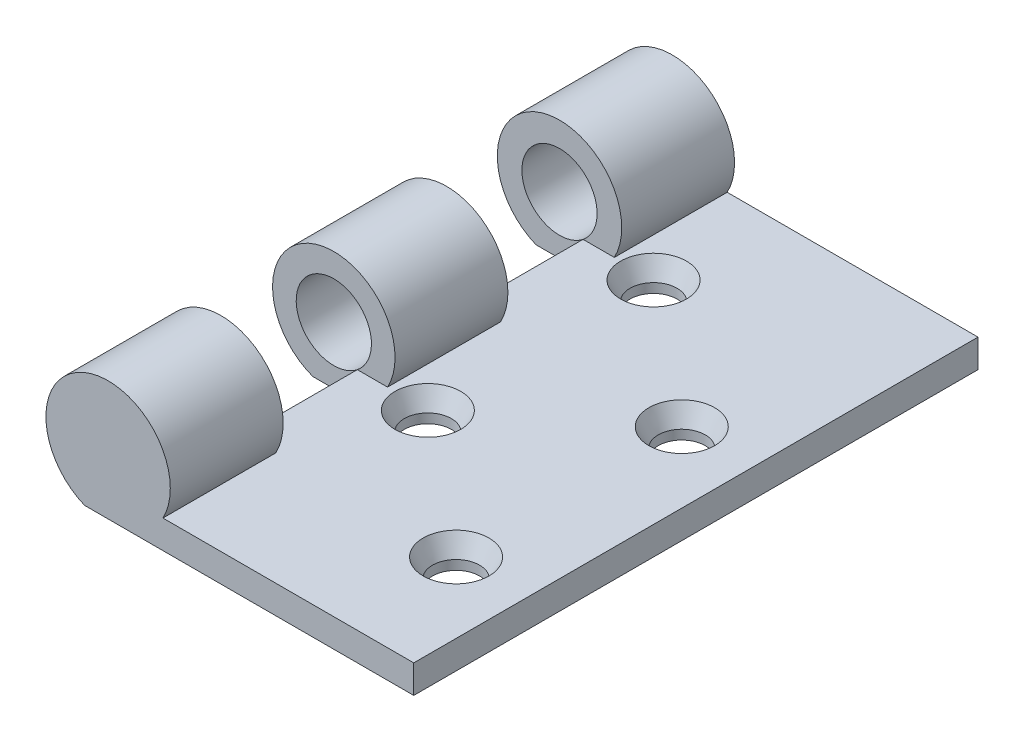
ISO-10303-21;
HEADER;
FILE_DESCRIPTION(('STEP AP214'),'2;1');
FILE_NAME('part.step','',(''),(''),'','','');
FILE_SCHEMA(('AUTOMOTIVE_DESIGN { 1 0 10303 214 1 1 1 1 }'));
ENDSEC;
DATA;
#1=APPLICATION_CONTEXT('core data for automotive mechanical design processes');
#2=APPLICATION_PROTOCOL_DEFINITION('international standard','automotive_design',2000,#1);
#3=PRODUCT_CONTEXT('',#1,'mechanical');
#4=PRODUCT('Part','Part','',(#3));
#5=PRODUCT_RELATED_PRODUCT_CATEGORY('part','',(#4));
#6=PRODUCT_DEFINITION_FORMATION('','',#4);
#7=PRODUCT_DEFINITION_CONTEXT('part definition',#1,'design');
#8=PRODUCT_DEFINITION('design','',#6,#7);
#9=PRODUCT_DEFINITION_SHAPE('','',#8);
#10=(LENGTH_UNIT() NAMED_UNIT(*) SI_UNIT(.MILLI.,.METRE.));
#11=(NAMED_UNIT(*) PLANE_ANGLE_UNIT() SI_UNIT($,.RADIAN.));
#12=(NAMED_UNIT(*) SI_UNIT($,.STERADIAN.) SOLID_ANGLE_UNIT());
#13=UNCERTAINTY_MEASURE_WITH_UNIT(LENGTH_MEASURE(1.E-05),#10,'distance_accuracy_value','');
#14=(GEOMETRIC_REPRESENTATION_CONTEXT(3) GLOBAL_UNCERTAINTY_ASSIGNED_CONTEXT((#13)) GLOBAL_UNIT_ASSIGNED_CONTEXT((#10,
#11,#12)) REPRESENTATION_CONTEXT('',''));
#15=CARTESIAN_POINT('',(0.,0.,0.));
#16=DIRECTION('',(0.,0.,1.));
#17=DIRECTION('',(1.,0.,0.));
#18=AXIS2_PLACEMENT_3D('',#15,#16,#17);
#19=CARTESIAN_POINT('',(-17.5,6.1224989991992,18.));
#20=DIRECTION('',(0.,0.,1.));
#21=DIRECTION('',(1.,0.,0.));
#22=AXIS2_PLACEMENT_3D('',#19,#20,#21);
#23=CYLINDRICAL_SURFACE('',#22,4.);
#24=CARTESIAN_POINT('',(-17.5,6.1224989991992,18.));
#25=DIRECTION('',(0.,0.,1.));
#26=DIRECTION('',(1.,0.,0.));
#27=AXIS2_PLACEMENT_3D('',#24,#25,#26);
#28=CIRCLE('',#27,4.);
#29=CARTESIAN_POINT('',(-15.,3.,18.));
#30=VERTEX_POINT('',#29);
#31=EDGE_CURVE('E198',#30,#30,#28,.T.);
#32=ORIENTED_EDGE('',*,*,#31,.F.);
#33=EDGE_LOOP('',(#32));
#34=FACE_BOUND('',#33,.T.);
#35=CARTESIAN_POINT('',(-17.5,6.1224989991992,28.));
#36=DIRECTION('',(0.,0.,1.));
#37=DIRECTION('',(1.,0.,0.));
#38=AXIS2_PLACEMENT_3D('',#35,#36,#37);
#39=CIRCLE('',#38,4.);
#40=CARTESIAN_POINT('',(-13.5,6.1224989991992,28.));
#41=VERTEX_POINT('',#40);
#42=EDGE_CURVE('E11',#41,#41,#39,.F.);
#43=ORIENTED_EDGE('',*,*,#42,.F.);
#44=EDGE_LOOP('',(#43));
#45=FACE_BOUND('',#44,.T.);
#46=ADVANCED_FACE('F46',(#34,#45),#23,.F.);
#47=CARTESIAN_POINT('',(-15.,3.,30.));
#48=DIRECTION('',(1.,0.,0.));
#49=DIRECTION('',(0.,0.,-1.));
#50=AXIS2_PLACEMENT_3D('',#47,#48,#49);
#51=PLANE('',#50);
#52=DIRECTION('',(0.,0.,1.));
#53=VECTOR('',#52,1.);
#54=CARTESIAN_POINT('',(-15.,3.,30.));
#55=LINE('',#54,#53);
#56=CARTESIAN_POINT('',(-15.,3.,6.));
#57=VERTEX_POINT('',#56);
#58=EDGE_CURVE('E225',#57,#30,#55,.T.);
#59=ORIENTED_EDGE('',*,*,#58,.F.);
#60=DIRECTION('',(0.,-1.,0.));
#61=VECTOR('',#60,1.);
#62=CARTESIAN_POINT('',(-15.,3.,6.));
#63=LINE('',#62,#61);
#64=CARTESIAN_POINT('',(-15.,0.108345974288909,6.));
#65=VERTEX_POINT('',#64);
#66=EDGE_CURVE('E172',#57,#65,#63,.T.);
#67=ORIENTED_EDGE('',*,*,#66,.T.);
#68=DIRECTION('',(0.,0.,-1.));
#69=VECTOR('',#68,1.);
#70=CARTESIAN_POINT('',(-15.,0.108345974288909,6.));
#71=LINE('',#70,#69);
#72=CARTESIAN_POINT('',(-15.,0.108345974288909,-6.));
#73=VERTEX_POINT('',#72);
#74=EDGE_CURVE('E164',#73,#65,#71,.F.);
#75=ORIENTED_EDGE('',*,*,#74,.F.);
#76=DIRECTION('',(0.,-1.,0.));
#77=VECTOR('',#76,1.);
#78=CARTESIAN_POINT('',(-15.,3.,-6.));
#79=LINE('',#78,#77);
#80=CARTESIAN_POINT('',(-15.,3.,-6.));
#81=VERTEX_POINT('',#80);
#82=EDGE_CURVE('E166',#81,#73,#79,.T.);
#83=ORIENTED_EDGE('',*,*,#82,.F.);
#84=CARTESIAN_POINT('',(-15.,3.,-18.));
#85=VERTEX_POINT('',#84);
#86=EDGE_CURVE('E221',#85,#81,#55,.T.);
#87=ORIENTED_EDGE('',*,*,#86,.F.);
#88=DIRECTION('',(0.,1.,0.));
#89=VECTOR('',#88,1.);
#90=CARTESIAN_POINT('',(-15.,3.,-18.));
#91=LINE('',#90,#89);
#92=CARTESIAN_POINT('',(-15.,0.,-18.));
#93=VERTEX_POINT('',#92);
#94=EDGE_CURVE('E195',#93,#85,#91,.T.);
#95=ORIENTED_EDGE('',*,*,#94,.F.);
#96=DIRECTION('',(0.,0.,1.));
#97=VECTOR('',#96,1.);
#98=CARTESIAN_POINT('',(-15.,0.,30.));
#99=LINE('',#98,#97);
#100=CARTESIAN_POINT('',(-15.,0.,18.));
#101=VERTEX_POINT('',#100);
#102=EDGE_CURVE('E220',#93,#101,#99,.T.);
#103=ORIENTED_EDGE('',*,*,#102,.T.);
#104=DIRECTION('',(0.,-1.,0.));
#105=VECTOR('',#104,1.);
#106=CARTESIAN_POINT('',(-15.,3.,18.));
#107=LINE('',#106,#105);
#108=EDGE_CURVE('E214',#30,#101,#107,.T.);
#109=ORIENTED_EDGE('',*,*,#108,.F.);
#110=EDGE_LOOP('',(#59,#67,#75,#83,#87,#95,#103,#109));
#111=FACE_BOUND('',#110,.T.);
#112=ADVANCED_FACE('F290',(#111),#51,.F.);
#113=CARTESIAN_POINT('',(0.,3.,0.));
#114=DIRECTION('',(0.,1.,0.));
#115=DIRECTION('',(0.,0.,1.));
#116=AXIS2_PLACEMENT_3D('',#113,#114,#115);
#117=PLANE('',#116);
#118=CARTESIAN_POINT('',(-7.5,3.,6.00000000000001));
#119=DIRECTION('',(0.,1.,0.));
#120=DIRECTION('',(0.,0.,1.));
#121=AXIS2_PLACEMENT_3D('',#118,#119,#120);
#122=CIRCLE('',#121,3.5);
#123=CARTESIAN_POINT('',(-7.5,3.,9.5));
#124=VERTEX_POINT('',#123);
#125=EDGE_CURVE('E262',#124,#124,#122,.F.);
#126=ORIENTED_EDGE('',*,*,#125,.T.);
#127=EDGE_LOOP('',(#126));
#128=FACE_BOUND('',#127,.T.);
#129=CARTESIAN_POINT('',(-7.5,3.,-18.));
#130=DIRECTION('',(0.,1.,0.));
#131=DIRECTION('',(0.,0.,1.));
#132=AXIS2_PLACEMENT_3D('',#129,#130,#131);
#133=CIRCLE('',#132,3.49999999999999);
#134=CARTESIAN_POINT('',(-7.5,3.,-14.5));
#135=VERTEX_POINT('',#134);
#136=EDGE_CURVE('E259',#135,#135,#133,.F.);
#137=ORIENTED_EDGE('',*,*,#136,.T.);
#138=EDGE_LOOP('',(#137));
#139=FACE_BOUND('',#138,.T.);
#140=CARTESIAN_POINT('',(7.5,3.,-6.));
#141=DIRECTION('',(0.,1.,0.));
#142=DIRECTION('',(0.,0.,1.));
#143=AXIS2_PLACEMENT_3D('',#140,#141,#142);
#144=CIRCLE('',#143,3.5);
#145=CARTESIAN_POINT('',(7.5,3.,-2.49999999999999));
#146=VERTEX_POINT('',#145);
#147=EDGE_CURVE('E256',#146,#146,#144,.F.);
#148=ORIENTED_EDGE('',*,*,#147,.T.);
#149=EDGE_LOOP('',(#148));
#150=FACE_BOUND('',#149,.T.);
#151=CARTESIAN_POINT('',(7.5,3.,18.));
#152=DIRECTION('',(0.,1.,0.));
#153=DIRECTION('',(0.,0.,1.));
#154=AXIS2_PLACEMENT_3D('',#151,#152,#153);
#155=CIRCLE('',#154,3.49999999999999);
#156=CARTESIAN_POINT('',(7.5,3.,21.5));
#157=VERTEX_POINT('',#156);
#158=EDGE_CURVE('E253',#157,#157,#155,.F.);
#159=ORIENTED_EDGE('',*,*,#158,.T.);
#160=EDGE_LOOP('',(#159));
#161=FACE_BOUND('',#160,.T.);
#162=DIRECTION('',(1.,0.,0.));
#163=VECTOR('',#162,1.);
#164=CARTESIAN_POINT('',(0.,3.,6.));
#165=LINE('',#164,#163);
#166=CARTESIAN_POINT('',(-11.7842291327383,3.,6.));
#167=VERTEX_POINT('',#166);
#168=EDGE_CURVE('E147',#57,#167,#165,.T.);
#169=ORIENTED_EDGE('',*,*,#168,.F.);
#170=ORIENTED_EDGE('',*,*,#58,.T.);
#171=DIRECTION('',(1.,0.,0.));
#172=VECTOR('',#171,1.);
#173=CARTESIAN_POINT('',(0.,3.,18.));
#174=LINE('',#173,#172);
#175=CARTESIAN_POINT('',(-11.6703350014606,3.,18.));
#176=VERTEX_POINT('',#175);
#177=EDGE_CURVE('E212',#30,#176,#174,.T.);
#178=ORIENTED_EDGE('',*,*,#177,.T.);
#179=DIRECTION('',(0.,0.,1.));
#180=VECTOR('',#179,1.);
#181=CARTESIAN_POINT('',(-11.6703350014606,3.,18.));
#182=LINE('',#181,#180);
#183=CARTESIAN_POINT('',(-11.6703350014606,3.,30.));
#184=VERTEX_POINT('',#183);
#185=EDGE_CURVE('E217',#184,#176,#182,.F.);
#186=ORIENTED_EDGE('',*,*,#185,.F.);
#187=DIRECTION('',(1.,0.,0.));
#188=VECTOR('',#187,1.);
#189=CARTESIAN_POINT('',(15.,3.,30.));
#190=LINE('',#189,#188);
#191=CARTESIAN_POINT('',(15.,3.,30.));
#192=VERTEX_POINT('',#191);
#193=EDGE_CURVE('E224',#184,#192,#190,.T.);
#194=ORIENTED_EDGE('',*,*,#193,.T.);
#195=DIRECTION('',(0.,0.,-1.));
#196=VECTOR('',#195,1.);
#197=CARTESIAN_POINT('',(15.,3.,30.));
#198=LINE('',#197,#196);
#199=CARTESIAN_POINT('',(15.,3.,-30.));
#200=VERTEX_POINT('',#199);
#201=EDGE_CURVE('E227',#192,#200,#198,.T.);
#202=ORIENTED_EDGE('',*,*,#201,.T.);
#203=DIRECTION('',(-1.,0.,0.));
#204=VECTOR('',#203,1.);
#205=CARTESIAN_POINT('',(15.,3.,-30.));
#206=LINE('',#205,#204);
#207=CARTESIAN_POINT('',(-11.6703350014606,3.,-30.));
#208=VERTEX_POINT('',#207);
#209=EDGE_CURVE('E229',#200,#208,#206,.T.);
#210=ORIENTED_EDGE('',*,*,#209,.T.);
#211=DIRECTION('',(0.,0.,-1.));
#212=VECTOR('',#211,1.);
#213=CARTESIAN_POINT('',(-11.6703350014606,3.,-18.));
#214=LINE('',#213,#212);
#215=CARTESIAN_POINT('',(-11.6703350014606,3.,-18.));
#216=VERTEX_POINT('',#215);
#217=EDGE_CURVE('E70',#208,#216,#214,.F.);
#218=ORIENTED_EDGE('',*,*,#217,.T.);
#219=DIRECTION('',(-1.,0.,0.));
#220=VECTOR('',#219,1.);
#221=CARTESIAN_POINT('',(0.,3.,-18.));
#222=LINE('',#221,#220);
#223=EDGE_CURVE('E193',#216,#85,#222,.T.);
#224=ORIENTED_EDGE('',*,*,#223,.T.);
#225=ORIENTED_EDGE('',*,*,#86,.T.);
#226=DIRECTION('',(1.,0.,0.));
#227=VECTOR('',#226,1.);
#228=CARTESIAN_POINT('',(0.,3.,-6.));
#229=LINE('',#228,#227);
#230=CARTESIAN_POINT('',(-11.7842291327383,3.,-6.));
#231=VERTEX_POINT('',#230);
#232=EDGE_CURVE('E246',#81,#231,#229,.T.);
#233=ORIENTED_EDGE('',*,*,#232,.T.);
#234=DIRECTION('',(0.,0.,-1.));
#235=VECTOR('',#234,1.);
#236=CARTESIAN_POINT('',(-11.7842291327383,3.,6.));
#237=LINE('',#236,#235);
#238=EDGE_CURVE('E244',#231,#167,#237,.F.);
#239=ORIENTED_EDGE('',*,*,#238,.T.);
#240=EDGE_LOOP('',(#169,#170,#178,#186,#194,#202,#210,#218,#224,#225,#233,#239));
#241=FACE_BOUND('',#240,.T.);
#242=ADVANCED_FACE('F296',(#128,#139,#150,#161,#241),#117,.T.);
#243=CARTESIAN_POINT('',(15.,3.,30.));
#244=DIRECTION('',(0.,0.,-1.));
#245=DIRECTION('',(-1.,0.,0.));
#246=AXIS2_PLACEMENT_3D('',#243,#244,#245);
#247=PLANE('',#246);
#248=CARTESIAN_POINT('',(-17.5,6.1224989991992,30.));
#249=DIRECTION('',(0.,0.,1.));
#250=DIRECTION('',(1.,0.,0.));
#251=AXIS2_PLACEMENT_3D('',#248,#249,#250);
#252=CIRCLE('',#251,6.61324383303649);
#253=CARTESIAN_POINT('',(-20.,0.,30.));
#254=VERTEX_POINT('',#253);
#255=EDGE_CURVE('E201',#184,#254,#252,.T.);
#256=ORIENTED_EDGE('',*,*,#255,.T.);
#257=DIRECTION('',(1.,0.,0.));
#258=VECTOR('',#257,1.);
#259=CARTESIAN_POINT('',(15.,0.,30.));
#260=LINE('',#259,#258);
#261=CARTESIAN_POINT('',(15.,0.,30.));
#262=VERTEX_POINT('',#261);
#263=EDGE_CURVE('E233',#254,#262,#260,.T.);
#264=ORIENTED_EDGE('',*,*,#263,.T.);
#265=DIRECTION('',(0.,-1.,0.));
#266=VECTOR('',#265,1.);
#267=CARTESIAN_POINT('',(15.,3.,30.));
#268=LINE('',#267,#266);
#269=EDGE_CURVE('E241',#192,#262,#268,.T.);
#270=ORIENTED_EDGE('',*,*,#269,.F.);
#271=ORIENTED_EDGE('',*,*,#193,.F.);
#272=EDGE_LOOP('',(#256,#264,#270,#271));
#273=FACE_BOUND('',#272,.T.);
#274=ADVANCED_FACE('F317',(#273),#247,.F.);
#275=CARTESIAN_POINT('',(15.,3.,30.));
#276=DIRECTION('',(-1.,0.,0.));
#277=DIRECTION('',(0.,0.,1.));
#278=AXIS2_PLACEMENT_3D('',#275,#276,#277);
#279=PLANE('',#278);
#280=DIRECTION('',(0.,0.,-1.));
#281=VECTOR('',#280,1.);
#282=CARTESIAN_POINT('',(15.,0.,30.));
#283=LINE('',#282,#281);
#284=CARTESIAN_POINT('',(15.,0.,-30.));
#285=VERTEX_POINT('',#284);
#286=EDGE_CURVE('E235',#262,#285,#283,.T.);
#287=ORIENTED_EDGE('',*,*,#286,.T.);
#288=DIRECTION('',(0.,-1.,0.));
#289=VECTOR('',#288,1.);
#290=CARTESIAN_POINT('',(15.,3.,-30.));
#291=LINE('',#290,#289);
#292=EDGE_CURVE('E231',#200,#285,#291,.T.);
#293=ORIENTED_EDGE('',*,*,#292,.F.);
#294=ORIENTED_EDGE('',*,*,#201,.F.);
#295=ORIENTED_EDGE('',*,*,#269,.T.);
#296=EDGE_LOOP('',(#287,#293,#294,#295));
#297=FACE_BOUND('',#296,.T.);
#298=ADVANCED_FACE('F325',(#297),#279,.F.);
#299=CARTESIAN_POINT('',(15.,3.,-30.));
#300=DIRECTION('',(0.,0.,1.));
#301=DIRECTION('',(1.,0.,0.));
#302=AXIS2_PLACEMENT_3D('',#299,#300,#301);
#303=PLANE('',#302);
#304=DIRECTION('',(-1.,0.,0.));
#305=VECTOR('',#304,1.);
#306=CARTESIAN_POINT('',(15.,0.,-30.));
#307=LINE('',#306,#305);
#308=CARTESIAN_POINT('',(-20.,0.,-30.));
#309=VERTEX_POINT('',#308);
#310=EDGE_CURVE('E237',#285,#309,#307,.T.);
#311=ORIENTED_EDGE('',*,*,#310,.T.);
#312=CARTESIAN_POINT('',(-17.5,6.1224989991992,-30.));
#313=DIRECTION('',(0.,0.,1.));
#314=DIRECTION('',(1.,0.,0.));
#315=AXIS2_PLACEMENT_3D('',#312,#313,#314);
#316=CIRCLE('',#315,6.61324383303649);
#317=EDGE_CURVE('E179',#208,#309,#316,.T.);
#318=ORIENTED_EDGE('',*,*,#317,.F.);
#319=ORIENTED_EDGE('',*,*,#209,.F.);
#320=ORIENTED_EDGE('',*,*,#292,.T.);
#321=EDGE_LOOP('',(#311,#318,#319,#320));
#322=FACE_BOUND('',#321,.T.);
#323=CARTESIAN_POINT('',(-17.5,6.1224989991992,-30.));
#324=DIRECTION('',(0.,0.,1.));
#325=DIRECTION('',(1.,0.,0.));
#326=AXIS2_PLACEMENT_3D('',#323,#324,#325);
#327=CIRCLE('',#326,4.);
#328=CARTESIAN_POINT('',(-13.5,6.1224989991992,-30.));
#329=VERTEX_POINT('',#328);
#330=EDGE_CURVE('E175',#329,#329,#327,.T.);
#331=ORIENTED_EDGE('',*,*,#330,.T.);
#332=EDGE_LOOP('',(#331));
#333=FACE_BOUND('',#332,.T.);
#334=ADVANCED_FACE('F321',(#322,#333),#303,.F.);
#335=CARTESIAN_POINT('',(0.,0.,0.));
#336=DIRECTION('',(0.,1.,0.));
#337=DIRECTION('',(0.,0.,1.));
#338=AXIS2_PLACEMENT_3D('',#335,#336,#337);
#339=PLANE('',#338);
#340=CARTESIAN_POINT('',(-7.5,0.,-18.));
#341=DIRECTION('',(0.,1.,0.));
#342=DIRECTION('',(0.,0.,1.));
#343=AXIS2_PLACEMENT_3D('',#340,#341,#342);
#344=CIRCLE('',#343,2.5);
#345=CARTESIAN_POINT('',(-7.5,0.,-15.5));
#346=VERTEX_POINT('',#345);
#347=EDGE_CURVE('E363',#346,#346,#344,.T.);
#348=ORIENTED_EDGE('',*,*,#347,.T.);
#349=EDGE_LOOP('',(#348));
#350=FACE_BOUND('',#349,.T.);
#351=CARTESIAN_POINT('',(-7.5,0.,6.00000000000001));
#352=DIRECTION('',(0.,1.,0.));
#353=DIRECTION('',(0.,0.,1.));
#354=AXIS2_PLACEMENT_3D('',#351,#352,#353);
#355=CIRCLE('',#354,2.5);
#356=CARTESIAN_POINT('',(-7.5,0.,8.50000000000001));
#357=VERTEX_POINT('',#356);
#358=EDGE_CURVE('E364',#357,#357,#355,.T.);
#359=ORIENTED_EDGE('',*,*,#358,.T.);
#360=EDGE_LOOP('',(#359));
#361=FACE_BOUND('',#360,.T.);
#362=CARTESIAN_POINT('',(7.5,0.,18.));
#363=DIRECTION('',(0.,1.,0.));
#364=DIRECTION('',(0.,0.,1.));
#365=AXIS2_PLACEMENT_3D('',#362,#363,#364);
#366=CIRCLE('',#365,2.5);
#367=CARTESIAN_POINT('',(7.5,0.,20.5));
#368=VERTEX_POINT('',#367);
#369=EDGE_CURVE('E367',#368,#368,#366,.T.);
#370=ORIENTED_EDGE('',*,*,#369,.T.);
#371=EDGE_LOOP('',(#370));
#372=FACE_BOUND('',#371,.T.);
#373=CARTESIAN_POINT('',(7.5,0.,-6.));
#374=DIRECTION('',(0.,1.,0.));
#375=DIRECTION('',(0.,0.,1.));
#376=AXIS2_PLACEMENT_3D('',#373,#374,#375);
#377=CIRCLE('',#376,2.5);
#378=CARTESIAN_POINT('',(7.5,0.,-3.5));
#379=VERTEX_POINT('',#378);
#380=EDGE_CURVE('E371',#379,#379,#377,.T.);
#381=ORIENTED_EDGE('',*,*,#380,.T.);
#382=EDGE_LOOP('',(#381));
#383=FACE_BOUND('',#382,.T.);
#384=ORIENTED_EDGE('',*,*,#102,.F.);
#385=DIRECTION('',(1.,0.,0.));
#386=VECTOR('',#385,1.);
#387=CARTESIAN_POINT('',(-15.,0.,-18.));
#388=LINE('',#387,#386);
#389=CARTESIAN_POINT('',(-20.,0.,-18.));
#390=VERTEX_POINT('',#389);
#391=EDGE_CURVE('E184',#390,#93,#388,.T.);
#392=ORIENTED_EDGE('',*,*,#391,.F.);
#393=DIRECTION('',(0.,0.,-1.));
#394=VECTOR('',#393,1.);
#395=CARTESIAN_POINT('',(-20.,0.,-18.));
#396=LINE('',#395,#394);
#397=EDGE_CURVE('E187',#390,#309,#396,.T.);
#398=ORIENTED_EDGE('',*,*,#397,.T.);
#399=ORIENTED_EDGE('',*,*,#310,.F.);
#400=ORIENTED_EDGE('',*,*,#286,.F.);
#401=ORIENTED_EDGE('',*,*,#263,.F.);
#402=DIRECTION('',(0.,0.,1.));
#403=VECTOR('',#402,1.);
#404=CARTESIAN_POINT('',(-20.,0.,18.));
#405=LINE('',#404,#403);
#406=CARTESIAN_POINT('',(-20.,0.,18.));
#407=VERTEX_POINT('',#406);
#408=EDGE_CURVE('E207',#407,#254,#405,.T.);
#409=ORIENTED_EDGE('',*,*,#408,.F.);
#410=DIRECTION('',(1.,0.,0.));
#411=VECTOR('',#410,1.);
#412=CARTESIAN_POINT('',(-15.,0.,18.));
#413=LINE('',#412,#411);
#414=EDGE_CURVE('E204',#407,#101,#413,.T.);
#415=ORIENTED_EDGE('',*,*,#414,.T.);
#416=EDGE_LOOP('',(#384,#392,#398,#399,#400,#401,#409,#415));
#417=FACE_BOUND('',#416,.T.);
#418=ADVANCED_FACE('F309',(#350,#361,#372,#383,#417),#339,.F.);
#419=CARTESIAN_POINT('',(-17.5,6.1224989991992,18.));
#420=DIRECTION('',(0.,0.,1.));
#421=DIRECTION('',(1.,0.,0.));
#422=AXIS2_PLACEMENT_3D('',#419,#420,#421);
#423=PLANE('',#422);
#424=ORIENTED_EDGE('',*,*,#31,.T.);
#425=ORIENTED_EDGE('',*,*,#108,.T.);
#426=ORIENTED_EDGE('',*,*,#414,.F.);
#427=CARTESIAN_POINT('',(-17.5,6.1224989991992,18.));
#428=DIRECTION('',(0.,0.,1.));
#429=DIRECTION('',(1.,0.,0.));
#430=AXIS2_PLACEMENT_3D('',#427,#428,#429);
#431=CIRCLE('',#430,6.61324383303649);
#432=EDGE_CURVE('E202',#176,#407,#431,.T.);
#433=ORIENTED_EDGE('',*,*,#432,.F.);
#434=ORIENTED_EDGE('',*,*,#177,.F.);
#435=EDGE_LOOP('',(#424,#425,#426,#433,#434));
#436=FACE_BOUND('',#435,.T.);
#437=ADVANCED_FACE('F305',(#436),#423,.F.);
#438=CARTESIAN_POINT('',(-17.5,6.1224989991992,18.));
#439=DIRECTION('',(0.,0.,1.));
#440=DIRECTION('',(1.,0.,0.));
#441=AXIS2_PLACEMENT_3D('',#438,#439,#440);
#442=CYLINDRICAL_SURFACE('',#441,6.61324383303649);
#443=ORIENTED_EDGE('',*,*,#255,.F.);
#444=ORIENTED_EDGE('',*,*,#185,.T.);
#445=ORIENTED_EDGE('',*,*,#432,.T.);
#446=ORIENTED_EDGE('',*,*,#408,.T.);
#447=EDGE_LOOP('',(#443,#444,#445,#446));
#448=FACE_BOUND('',#447,.T.);
#449=ADVANCED_FACE('F308',(#448),#442,.T.);
#450=CARTESIAN_POINT('',(-17.5,6.1224989991992,-18.));
#451=DIRECTION('',(0.,0.,-1.));
#452=DIRECTION('',(1.,0.,0.));
#453=AXIS2_PLACEMENT_3D('',#450,#451,#452);
#454=PLANE('',#453);
#455=ORIENTED_EDGE('',*,*,#391,.T.);
#456=ORIENTED_EDGE('',*,*,#94,.T.);
#457=CARTESIAN_POINT('',(-17.5,6.1224989991992,-18.));
#458=DIRECTION('',(0.,0.,1.));
#459=DIRECTION('',(1.,0.,0.));
#460=AXIS2_PLACEMENT_3D('',#457,#458,#459);
#461=CIRCLE('',#460,4.);
#462=EDGE_CURVE('E176',#85,#85,#461,.T.);
#463=ORIENTED_EDGE('',*,*,#462,.F.);
#464=ORIENTED_EDGE('',*,*,#223,.F.);
#465=CARTESIAN_POINT('',(-17.5,6.1224989991992,-18.));
#466=DIRECTION('',(0.,0.,1.));
#467=DIRECTION('',(1.,0.,0.));
#468=AXIS2_PLACEMENT_3D('',#465,#466,#467);
#469=CIRCLE('',#468,6.61324383303649);
#470=EDGE_CURVE('E182',#216,#390,#469,.T.);
#471=ORIENTED_EDGE('',*,*,#470,.T.);
#472=EDGE_LOOP('',(#455,#456,#463,#464,#471));
#473=FACE_BOUND('',#472,.T.);
#474=ADVANCED_FACE('F313',(#473),#454,.F.);
#475=CARTESIAN_POINT('',(-17.5,6.1224989991992,-18.));
#476=DIRECTION('',(0.,0.,-1.));
#477=DIRECTION('',(-1.,0.,0.));
#478=AXIS2_PLACEMENT_3D('',#475,#476,#477);
#479=CYLINDRICAL_SURFACE('',#478,6.61324383303649);
#480=ORIENTED_EDGE('',*,*,#217,.F.);
#481=ORIENTED_EDGE('',*,*,#317,.T.);
#482=ORIENTED_EDGE('',*,*,#397,.F.);
#483=ORIENTED_EDGE('',*,*,#470,.F.);
#484=EDGE_LOOP('',(#480,#481,#482,#483));
#485=FACE_BOUND('',#484,.T.);
#486=ADVANCED_FACE('F303',(#485),#479,.T.);
#487=CARTESIAN_POINT('',(-17.5,6.1224989991992,-18.));
#488=DIRECTION('',(0.,0.,-1.));
#489=DIRECTION('',(-1.,0.,0.));
#490=AXIS2_PLACEMENT_3D('',#487,#488,#489);
#491=CYLINDRICAL_SURFACE('',#490,4.);
#492=ORIENTED_EDGE('',*,*,#462,.T.);
#493=EDGE_LOOP('',(#492));
#494=FACE_BOUND('',#493,.T.);
#495=ORIENTED_EDGE('',*,*,#330,.F.);
#496=EDGE_LOOP('',(#495));
#497=FACE_BOUND('',#496,.T.);
#498=ADVANCED_FACE('F404',(#494,#497),#491,.F.);
#499=CARTESIAN_POINT('',(-17.5,6.1224989991992,6.));
#500=DIRECTION('',(0.,0.,1.));
#501=DIRECTION('',(1.,0.,0.));
#502=AXIS2_PLACEMENT_3D('',#499,#500,#501);
#503=PLANE('',#502);
#504=ORIENTED_EDGE('',*,*,#66,.F.);
#505=CARTESIAN_POINT('',(-17.5,6.1224989991992,6.));
#506=DIRECTION('',(0.,0.,1.));
#507=DIRECTION('',(1.,0.,0.));
#508=AXIS2_PLACEMENT_3D('',#505,#506,#507);
#509=CIRCLE('',#508,4.);
#510=EDGE_CURVE('E375',#57,#57,#509,.T.);
#511=ORIENTED_EDGE('',*,*,#510,.F.);
#512=ORIENTED_EDGE('',*,*,#168,.T.);
#513=CARTESIAN_POINT('',(-17.5,6.1224989991992,6.));
#514=DIRECTION('',(0.,0.,1.));
#515=DIRECTION('',(1.,0.,0.));
#516=AXIS2_PLACEMENT_3D('',#513,#514,#515);
#517=CIRCLE('',#516,6.51306660545074);
#518=CARTESIAN_POINT('',(-19.7214955799736,0.,6.));
#519=VERTEX_POINT('',#518);
#520=EDGE_CURVE('E62',#167,#519,#517,.T.);
#521=ORIENTED_EDGE('',*,*,#520,.T.);
#522=DIRECTION('',(1.,0.,0.));
#523=VECTOR('',#522,1.);
#524=CARTESIAN_POINT('',(-19.7214955799736,0.,6.));
#525=LINE('',#524,#523);
#526=CARTESIAN_POINT('',(-15.2785044200264,0.,6.));
#527=VERTEX_POINT('',#526);
#528=EDGE_CURVE('E143',#519,#527,#525,.T.);
#529=ORIENTED_EDGE('',*,*,#528,.T.);
#530=EDGE_CURVE('E149',#527,#65,#517,.T.);
#531=ORIENTED_EDGE('',*,*,#530,.T.);
#532=EDGE_LOOP('',(#504,#511,#512,#521,#529,#531));
#533=FACE_BOUND('',#532,.T.);
#534=ADVANCED_FACE('F141',(#533),#503,.T.);
#535=CARTESIAN_POINT('',(-17.5,6.1224989991992,-6.));
#536=DIRECTION('',(0.,0.,1.));
#537=DIRECTION('',(1.,0.,0.));
#538=AXIS2_PLACEMENT_3D('',#535,#536,#537);
#539=PLANE('',#538);
#540=CARTESIAN_POINT('',(-17.5,6.1224989991992,-6.));
#541=DIRECTION('',(0.,0.,1.));
#542=DIRECTION('',(1.,0.,0.));
#543=AXIS2_PLACEMENT_3D('',#540,#541,#542);
#544=CIRCLE('',#543,4.);
#545=EDGE_CURVE('E374',#81,#81,#544,.T.);
#546=ORIENTED_EDGE('',*,*,#545,.T.);
#547=ORIENTED_EDGE('',*,*,#82,.T.);
#548=CARTESIAN_POINT('',(-17.5,6.1224989991992,-6.));
#549=DIRECTION('',(0.,0.,1.));
#550=DIRECTION('',(1.,0.,0.));
#551=AXIS2_PLACEMENT_3D('',#548,#549,#550);
#552=CIRCLE('',#551,6.51306660545074);
#553=CARTESIAN_POINT('',(-15.2785044200264,0.,-6.));
#554=VERTEX_POINT('',#553);
#555=EDGE_CURVE('E380',#554,#73,#552,.T.);
#556=ORIENTED_EDGE('',*,*,#555,.F.);
#557=DIRECTION('',(1.,0.,0.));
#558=VECTOR('',#557,1.);
#559=CARTESIAN_POINT('',(-19.7214955799736,0.,-6.));
#560=LINE('',#559,#558);
#561=CARTESIAN_POINT('',(-19.7214955799736,0.,-6.));
#562=VERTEX_POINT('',#561);
#563=EDGE_CURVE('E150',#562,#554,#560,.T.);
#564=ORIENTED_EDGE('',*,*,#563,.F.);
#565=EDGE_CURVE('E162',#231,#562,#552,.T.);
#566=ORIENTED_EDGE('',*,*,#565,.F.);
#567=ORIENTED_EDGE('',*,*,#232,.F.);
#568=EDGE_LOOP('',(#546,#547,#556,#564,#566,#567));
#569=FACE_BOUND('',#568,.T.);
#570=ADVANCED_FACE('F387',(#569),#539,.F.);
#571=CARTESIAN_POINT('',(-17.5,6.1224989991992,6.));
#572=DIRECTION('',(0.,0.,-1.));
#573=DIRECTION('',(-1.,0.,0.));
#574=AXIS2_PLACEMENT_3D('',#571,#572,#573);
#575=CYLINDRICAL_SURFACE('',#574,6.51306660545074);
#576=ORIENTED_EDGE('',*,*,#555,.T.);
#577=ORIENTED_EDGE('',*,*,#74,.T.);
#578=ORIENTED_EDGE('',*,*,#530,.F.);
#579=DIRECTION('',(0.,0.,-1.));
#580=VECTOR('',#579,1.);
#581=CARTESIAN_POINT('',(-15.2785044200264,0.,6.));
#582=LINE('',#581,#580);
#583=EDGE_CURVE('E157',#527,#554,#582,.T.);
#584=ORIENTED_EDGE('',*,*,#583,.T.);
#585=EDGE_LOOP('',(#576,#577,#578,#584));
#586=FACE_BOUND('',#585,.T.);
#587=ADVANCED_FACE('F385',(#586),#575,.T.);
#588=ORIENTED_EDGE('',*,*,#238,.F.);
#589=ORIENTED_EDGE('',*,*,#565,.T.);
#590=DIRECTION('',(0.,0.,-1.));
#591=VECTOR('',#590,1.);
#592=CARTESIAN_POINT('',(-19.7214955799736,0.,6.));
#593=LINE('',#592,#591);
#594=EDGE_CURVE('E155',#519,#562,#593,.T.);
#595=ORIENTED_EDGE('',*,*,#594,.F.);
#596=ORIENTED_EDGE('',*,*,#520,.F.);
#597=EDGE_LOOP('',(#588,#589,#595,#596));
#598=FACE_BOUND('',#597,.T.);
#599=ADVANCED_FACE('F160',(#598),#575,.T.);
#600=CARTESIAN_POINT('',(-19.7214955799736,0.,6.));
#601=DIRECTION('',(0.,1.,0.));
#602=DIRECTION('',(0.,0.,1.));
#603=AXIS2_PLACEMENT_3D('',#600,#601,#602);
#604=PLANE('',#603);
#605=ORIENTED_EDGE('',*,*,#563,.T.);
#606=ORIENTED_EDGE('',*,*,#583,.F.);
#607=ORIENTED_EDGE('',*,*,#528,.F.);
#608=ORIENTED_EDGE('',*,*,#594,.T.);
#609=EDGE_LOOP('',(#605,#606,#607,#608));
#610=FACE_BOUND('',#609,.T.);
#611=ADVANCED_FACE('F154',(#610),#604,.F.);
#612=CARTESIAN_POINT('',(-17.5,6.1224989991992,6.));
#613=DIRECTION('',(0.,0.,-1.));
#614=DIRECTION('',(-1.,0.,0.));
#615=AXIS2_PLACEMENT_3D('',#612,#613,#614);
#616=CYLINDRICAL_SURFACE('',#615,4.);
#617=ORIENTED_EDGE('',*,*,#510,.T.);
#618=EDGE_LOOP('',(#617));
#619=FACE_BOUND('',#618,.T.);
#620=ORIENTED_EDGE('',*,*,#545,.F.);
#621=EDGE_LOOP('',(#620));
#622=FACE_BOUND('',#621,.T.);
#623=ADVANCED_FACE('F468',(#619,#622),#616,.F.);
#624=CARTESIAN_POINT('',(7.5,0.,-6.));
#625=DIRECTION('',(0.,1.,0.));
#626=DIRECTION('',(0.,0.,1.));
#627=AXIS2_PLACEMENT_3D('',#624,#625,#626);
#628=CYLINDRICAL_SURFACE('',#627,2.5);
#629=CARTESIAN_POINT('',(7.5,0.999999999999982,-6.));
#630=DIRECTION('',(0.,1.,0.));
#631=DIRECTION('',(0.,0.,1.));
#632=AXIS2_PLACEMENT_3D('',#629,#630,#631);
#633=CIRCLE('',#632,2.5);
#634=CARTESIAN_POINT('',(7.5,0.999999999999982,-3.5));
#635=VERTEX_POINT('',#634);
#636=EDGE_CURVE('E268',#635,#635,#633,.T.);
#637=ORIENTED_EDGE('',*,*,#636,.T.);
#638=EDGE_LOOP('',(#637));
#639=FACE_BOUND('',#638,.T.);
#640=ORIENTED_EDGE('',*,*,#380,.F.);
#641=EDGE_LOOP('',(#640));
#642=FACE_BOUND('',#641,.T.);
#643=ADVANCED_FACE('F476',(#639,#642),#628,.F.);
#644=CARTESIAN_POINT('',(7.5,0.,18.));
#645=DIRECTION('',(0.,1.,0.));
#646=DIRECTION('',(0.,0.,1.));
#647=AXIS2_PLACEMENT_3D('',#644,#645,#646);
#648=CYLINDRICAL_SURFACE('',#647,2.5);
#649=CARTESIAN_POINT('',(7.5,1.,18.));
#650=DIRECTION('',(0.,1.,0.));
#651=DIRECTION('',(0.,0.,1.));
#652=AXIS2_PLACEMENT_3D('',#649,#650,#651);
#653=CIRCLE('',#652,2.5);
#654=CARTESIAN_POINT('',(7.5,1.,20.5));
#655=VERTEX_POINT('',#654);
#656=EDGE_CURVE('E55',#655,#655,#653,.T.);
#657=ORIENTED_EDGE('',*,*,#656,.T.);
#658=EDGE_LOOP('',(#657));
#659=FACE_BOUND('',#658,.T.);
#660=ORIENTED_EDGE('',*,*,#369,.F.);
#661=EDGE_LOOP('',(#660));
#662=FACE_BOUND('',#661,.T.);
#663=ADVANCED_FACE('F273',(#659,#662),#648,.F.);
#664=CARTESIAN_POINT('',(-7.5,0.,6.00000000000001));
#665=DIRECTION('',(0.,1.,0.));
#666=DIRECTION('',(0.,0.,1.));
#667=AXIS2_PLACEMENT_3D('',#664,#665,#666);
#668=CYLINDRICAL_SURFACE('',#667,2.5);
#669=CARTESIAN_POINT('',(-7.5,1.00000000000001,6.00000000000001));
#670=DIRECTION('',(0.,1.,0.));
#671=DIRECTION('',(0.,0.,1.));
#672=AXIS2_PLACEMENT_3D('',#669,#670,#671);
#673=CIRCLE('',#672,2.5);
#674=CARTESIAN_POINT('',(-7.5,1.00000000000001,8.50000000000001));
#675=VERTEX_POINT('',#674);
#676=EDGE_CURVE('E250',#675,#675,#673,.T.);
#677=ORIENTED_EDGE('',*,*,#676,.T.);
#678=EDGE_LOOP('',(#677));
#679=FACE_BOUND('',#678,.T.);
#680=ORIENTED_EDGE('',*,*,#358,.F.);
#681=EDGE_LOOP('',(#680));
#682=FACE_BOUND('',#681,.T.);
#683=ADVANCED_FACE('F359',(#679,#682),#668,.F.);
#684=CARTESIAN_POINT('',(-7.5,0.,-18.));
#685=DIRECTION('',(0.,1.,0.));
#686=DIRECTION('',(0.,0.,1.));
#687=AXIS2_PLACEMENT_3D('',#684,#685,#686);
#688=CYLINDRICAL_SURFACE('',#687,2.5);
#689=CARTESIAN_POINT('',(-7.5,1.,-18.));
#690=DIRECTION('',(0.,1.,0.));
#691=DIRECTION('',(0.,0.,1.));
#692=AXIS2_PLACEMENT_3D('',#689,#690,#691);
#693=CIRCLE('',#692,2.5);
#694=CARTESIAN_POINT('',(-7.5,1.,-15.5));
#695=VERTEX_POINT('',#694);
#696=EDGE_CURVE('E265',#695,#695,#693,.T.);
#697=ORIENTED_EDGE('',*,*,#696,.T.);
#698=EDGE_LOOP('',(#697));
#699=FACE_BOUND('',#698,.T.);
#700=ORIENTED_EDGE('',*,*,#347,.F.);
#701=EDGE_LOOP('',(#700));
#702=FACE_BOUND('',#701,.T.);
#703=ADVANCED_FACE('F340',(#699,#702),#688,.F.);
#704=CARTESIAN_POINT('',(-7.5,1.00000000000001,6.00000000000001));
#705=DIRECTION('',(0.,1.,0.));
#706=DIRECTION('',(0.,0.,1.));
#707=AXIS2_PLACEMENT_3D('',#704,#705,#706);
#708=CONICAL_SURFACE('',#707,2.5,0.463647609000806);
#709=ORIENTED_EDGE('',*,*,#125,.F.);
#710=EDGE_LOOP('',(#709));
#711=FACE_BOUND('',#710,.T.);
#712=ORIENTED_EDGE('',*,*,#676,.F.);
#713=EDGE_LOOP('',(#712));
#714=FACE_BOUND('',#713,.T.);
#715=ADVANCED_FACE('F334',(#711,#714),#708,.F.);
#716=CARTESIAN_POINT('',(-7.5,1.,-18.));
#717=DIRECTION('',(0.,1.,0.));
#718=DIRECTION('',(0.,0.,1.));
#719=AXIS2_PLACEMENT_3D('',#716,#717,#718);
#720=CONICAL_SURFACE('',#719,2.5,0.463647609000802);
#721=ORIENTED_EDGE('',*,*,#136,.F.);
#722=EDGE_LOOP('',(#721));
#723=FACE_BOUND('',#722,.T.);
#724=ORIENTED_EDGE('',*,*,#696,.F.);
#725=EDGE_LOOP('',(#724));
#726=FACE_BOUND('',#725,.T.);
#727=ADVANCED_FACE('F286',(#723,#726),#720,.F.);
#728=CARTESIAN_POINT('',(7.5,0.999999999999982,-6.));
#729=DIRECTION('',(0.,1.,0.));
#730=DIRECTION('',(0.,0.,1.));
#731=AXIS2_PLACEMENT_3D('',#728,#729,#730);
#732=CONICAL_SURFACE('',#731,2.5,0.463647609000804);
#733=ORIENTED_EDGE('',*,*,#147,.F.);
#734=EDGE_LOOP('',(#733));
#735=FACE_BOUND('',#734,.T.);
#736=ORIENTED_EDGE('',*,*,#636,.F.);
#737=EDGE_LOOP('',(#736));
#738=FACE_BOUND('',#737,.T.);
#739=ADVANCED_FACE('F278',(#735,#738),#732,.F.);
#740=CARTESIAN_POINT('',(7.5,1.,18.));
#741=DIRECTION('',(0.,1.,0.));
#742=DIRECTION('',(0.,0.,1.));
#743=AXIS2_PLACEMENT_3D('',#740,#741,#742);
#744=CONICAL_SURFACE('',#743,2.5,0.463647609000802);
#745=ORIENTED_EDGE('',*,*,#158,.F.);
#746=EDGE_LOOP('',(#745));
#747=FACE_BOUND('',#746,.T.);
#748=ORIENTED_EDGE('',*,*,#656,.F.);
#749=EDGE_LOOP('',(#748));
#750=FACE_BOUND('',#749,.T.);
#751=ADVANCED_FACE('F49',(#747,#750),#744,.F.);
#752=CARTESIAN_POINT('',(-17.5,6.1224989991992,28.));
#753=DIRECTION('',(0.,0.,1.));
#754=DIRECTION('',(1.,0.,0.));
#755=AXIS2_PLACEMENT_3D('',#752,#753,#754);
#756=PLANE('',#755);
#757=ORIENTED_EDGE('',*,*,#42,.T.);
#758=EDGE_LOOP('',(#757));
#759=FACE_BOUND('',#758,.T.);
#760=ADVANCED_FACE('F277',(#759),#756,.F.);
#761=CLOSED_SHELL('',(#46,#112,#242,#274,#298,#334,#418,#437,#449,#474,#486,#498,#534,#570,#587,
#599,#611,#623,#643,#663,#683,#703,#715,#727,#739,#751,#760));
#762=MANIFOLD_SOLID_BREP('B2',#761);
#763=ADVANCED_BREP_SHAPE_REPRESENTATION('',(#18,#762),#14);
#764=SHAPE_DEFINITION_REPRESENTATION(#9,#763);
ENDSEC;
END-ISO-10303-21;
